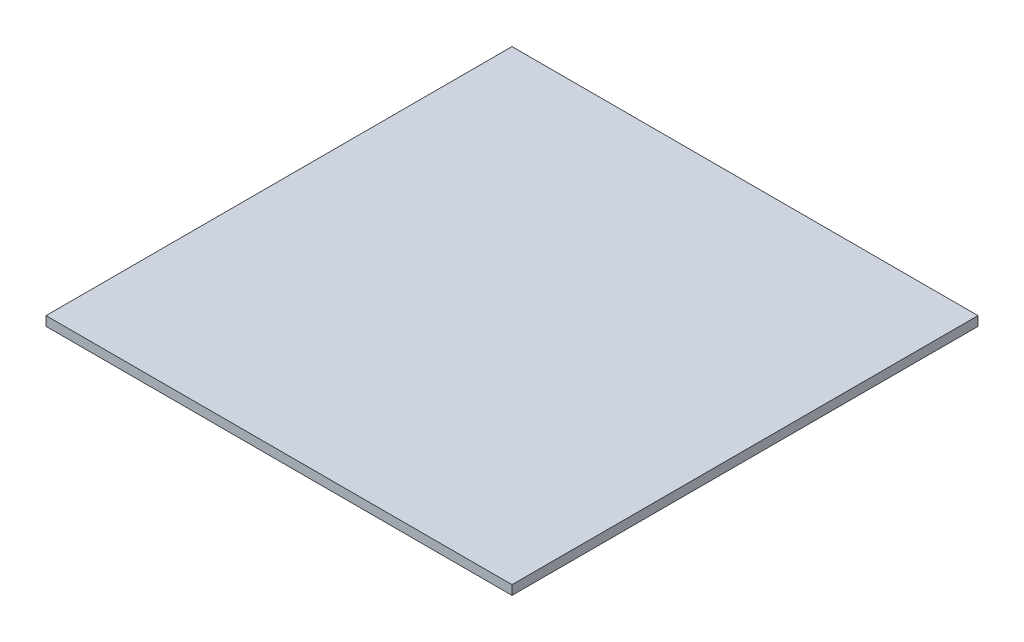
ISO-10303-21;
HEADER;
FILE_DESCRIPTION(('STEP AP214'),'2;1');
FILE_NAME('part.step','',(''),(''),'','','');
FILE_SCHEMA(('AUTOMOTIVE_DESIGN { 1 0 10303 214 1 1 1 1 }'));
ENDSEC;
DATA;
#1=APPLICATION_CONTEXT('core data for automotive mechanical design processes');
#2=APPLICATION_PROTOCOL_DEFINITION('international standard','automotive_design',2000,#1);
#3=PRODUCT_CONTEXT('',#1,'mechanical');
#4=PRODUCT('Part','Part','',(#3));
#5=PRODUCT_RELATED_PRODUCT_CATEGORY('part','',(#4));
#6=PRODUCT_DEFINITION_FORMATION('','',#4);
#7=PRODUCT_DEFINITION_CONTEXT('part definition',#1,'design');
#8=PRODUCT_DEFINITION('design','',#6,#7);
#9=PRODUCT_DEFINITION_SHAPE('','',#8);
#10=(LENGTH_UNIT() NAMED_UNIT(*) SI_UNIT(.MILLI.,.METRE.));
#11=(NAMED_UNIT(*) PLANE_ANGLE_UNIT() SI_UNIT($,.RADIAN.));
#12=(NAMED_UNIT(*) SI_UNIT($,.STERADIAN.) SOLID_ANGLE_UNIT());
#13=UNCERTAINTY_MEASURE_WITH_UNIT(LENGTH_MEASURE(1.E-05),#10,'distance_accuracy_value','');
#14=(GEOMETRIC_REPRESENTATION_CONTEXT(3) GLOBAL_UNCERTAINTY_ASSIGNED_CONTEXT((#13)) GLOBAL_UNIT_ASSIGNED_CONTEXT((#10,
#11,#12)) REPRESENTATION_CONTEXT('',''));
#15=CARTESIAN_POINT('',(0.,0.,0.));
#16=DIRECTION('',(0.,0.,1.));
#17=DIRECTION('',(1.,0.,0.));
#18=AXIS2_PLACEMENT_3D('',#15,#16,#17);
#19=CARTESIAN_POINT('',(0.,-25.4,0.));
#20=DIRECTION('',(-1.,0.,0.));
#21=DIRECTION('',(0.,0.,1.));
#22=AXIS2_PLACEMENT_3D('',#19,#20,#21);
#23=PLANE('',#22);
#24=DIRECTION('',(0.,0.,1.));
#25=VECTOR('',#24,1.);
#26=CARTESIAN_POINT('',(0.,0.,0.));
#27=LINE('',#26,#25);
#28=CARTESIAN_POINT('',(0.,0.,-1270.));
#29=VERTEX_POINT('',#28);
#30=CARTESIAN_POINT('',(0.,0.,0.));
#31=VERTEX_POINT('',#30);
#32=EDGE_CURVE('E100',#29,#31,#27,.T.);
#33=ORIENTED_EDGE('',*,*,#32,.F.);
#34=DIRECTION('',(0.,1.,0.));
#35=VECTOR('',#34,1.);
#36=CARTESIAN_POINT('',(0.,-25.4,-1270.));
#37=LINE('',#36,#35);
#38=CARTESIAN_POINT('',(0.,-25.4,-1270.));
#39=VERTEX_POINT('',#38);
#40=EDGE_CURVE('E11',#39,#29,#37,.T.);
#41=ORIENTED_EDGE('',*,*,#40,.F.);
#42=DIRECTION('',(0.,0.,1.));
#43=VECTOR('',#42,1.);
#44=CARTESIAN_POINT('',(0.,-25.4,0.));
#45=LINE('',#44,#43);
#46=CARTESIAN_POINT('',(0.,-25.4,0.));
#47=VERTEX_POINT('',#46);
#48=EDGE_CURVE('E94',#39,#47,#45,.T.);
#49=ORIENTED_EDGE('',*,*,#48,.T.);
#50=DIRECTION('',(0.,1.,0.));
#51=VECTOR('',#50,1.);
#52=CARTESIAN_POINT('',(0.,-25.4,0.));
#53=LINE('',#52,#51);
#54=EDGE_CURVE('E39',#47,#31,#53,.T.);
#55=ORIENTED_EDGE('',*,*,#54,.T.);
#56=EDGE_LOOP('',(#33,#41,#49,#55));
#57=FACE_BOUND('',#56,.T.);
#58=ADVANCED_FACE('F36',(#57),#23,.T.);
#59=CARTESIAN_POINT('',(0.,-25.4,-1270.));
#60=DIRECTION('',(0.,0.,-1.));
#61=DIRECTION('',(-1.,0.,0.));
#62=AXIS2_PLACEMENT_3D('',#59,#60,#61);
#63=PLANE('',#62);
#64=DIRECTION('',(-1.,0.,0.));
#65=VECTOR('',#64,1.);
#66=CARTESIAN_POINT('',(0.,0.,-1270.));
#67=LINE('',#66,#65);
#68=CARTESIAN_POINT('',(1270.,0.,-1270.));
#69=VERTEX_POINT('',#68);
#70=EDGE_CURVE('E96',#69,#29,#67,.T.);
#71=ORIENTED_EDGE('',*,*,#70,.F.);
#72=DIRECTION('',(0.,1.,0.));
#73=VECTOR('',#72,1.);
#74=CARTESIAN_POINT('',(1270.,-25.4,-1270.));
#75=LINE('',#74,#73);
#76=CARTESIAN_POINT('',(1270.,-25.4,-1270.));
#77=VERTEX_POINT('',#76);
#78=EDGE_CURVE('E45',#77,#69,#75,.T.);
#79=ORIENTED_EDGE('',*,*,#78,.F.);
#80=DIRECTION('',(-1.,0.,0.));
#81=VECTOR('',#80,1.);
#82=CARTESIAN_POINT('',(0.,-25.4,-1270.));
#83=LINE('',#82,#81);
#84=EDGE_CURVE('E91',#77,#39,#83,.T.);
#85=ORIENTED_EDGE('',*,*,#84,.T.);
#86=ORIENTED_EDGE('',*,*,#40,.T.);
#87=EDGE_LOOP('',(#71,#79,#85,#86));
#88=FACE_BOUND('',#87,.T.);
#89=ADVANCED_FACE('F110',(#88),#63,.T.);
#90=CARTESIAN_POINT('',(1270.,-25.4,0.));
#91=DIRECTION('',(1.,0.,0.));
#92=DIRECTION('',(0.,0.,-1.));
#93=AXIS2_PLACEMENT_3D('',#90,#91,#92);
#94=PLANE('',#93);
#95=DIRECTION('',(0.,0.,-1.));
#96=VECTOR('',#95,1.);
#97=CARTESIAN_POINT('',(1270.,0.,0.));
#98=LINE('',#97,#96);
#99=CARTESIAN_POINT('',(1270.,0.,0.));
#100=VERTEX_POINT('',#99);
#101=EDGE_CURVE('E86',#100,#69,#98,.T.);
#102=ORIENTED_EDGE('',*,*,#101,.F.);
#103=DIRECTION('',(0.,1.,0.));
#104=VECTOR('',#103,1.);
#105=CARTESIAN_POINT('',(1270.,-25.4,0.));
#106=LINE('',#105,#104);
#107=CARTESIAN_POINT('',(1270.,-25.4,0.));
#108=VERTEX_POINT('',#107);
#109=EDGE_CURVE('E81',#108,#100,#106,.T.);
#110=ORIENTED_EDGE('',*,*,#109,.F.);
#111=DIRECTION('',(0.,0.,-1.));
#112=VECTOR('',#111,1.);
#113=CARTESIAN_POINT('',(1270.,-25.4,0.));
#114=LINE('',#113,#112);
#115=EDGE_CURVE('E84',#108,#77,#114,.T.);
#116=ORIENTED_EDGE('',*,*,#115,.T.);
#117=ORIENTED_EDGE('',*,*,#78,.T.);
#118=EDGE_LOOP('',(#102,#110,#116,#117));
#119=FACE_BOUND('',#118,.T.);
#120=ADVANCED_FACE('F83',(#119),#94,.T.);
#121=CARTESIAN_POINT('',(0.,-25.4,0.));
#122=DIRECTION('',(0.,0.,1.));
#123=DIRECTION('',(1.,0.,0.));
#124=AXIS2_PLACEMENT_3D('',#121,#122,#123);
#125=PLANE('',#124);
#126=DIRECTION('',(1.,0.,0.));
#127=VECTOR('',#126,1.);
#128=CARTESIAN_POINT('',(0.,0.,0.));
#129=LINE('',#128,#127);
#130=EDGE_CURVE('E103',#31,#100,#129,.T.);
#131=ORIENTED_EDGE('',*,*,#130,.F.);
#132=ORIENTED_EDGE('',*,*,#54,.F.);
#133=DIRECTION('',(1.,0.,0.));
#134=VECTOR('',#133,1.);
#135=CARTESIAN_POINT('',(0.,-25.4,0.));
#136=LINE('',#135,#134);
#137=EDGE_CURVE('E90',#47,#108,#136,.T.);
#138=ORIENTED_EDGE('',*,*,#137,.T.);
#139=ORIENTED_EDGE('',*,*,#109,.T.);
#140=EDGE_LOOP('',(#131,#132,#138,#139));
#141=FACE_BOUND('',#140,.T.);
#142=ADVANCED_FACE('F93',(#141),#125,.T.);
#143=CARTESIAN_POINT('',(0.,-25.4,0.));
#144=DIRECTION('',(0.,-1.,0.));
#145=DIRECTION('',(0.,0.,-1.));
#146=AXIS2_PLACEMENT_3D('',#143,#144,#145);
#147=PLANE('',#146);
#148=ORIENTED_EDGE('',*,*,#48,.F.);
#149=ORIENTED_EDGE('',*,*,#84,.F.);
#150=ORIENTED_EDGE('',*,*,#115,.F.);
#151=ORIENTED_EDGE('',*,*,#137,.F.);
#152=EDGE_LOOP('',(#148,#149,#150,#151));
#153=FACE_BOUND('',#152,.T.);
#154=ADVANCED_FACE('F89',(#153),#147,.T.);
#155=CARTESIAN_POINT('',(0.,0.,0.));
#156=DIRECTION('',(0.,-1.,0.));
#157=DIRECTION('',(0.,0.,-1.));
#158=AXIS2_PLACEMENT_3D('',#155,#156,#157);
#159=PLANE('',#158);
#160=ORIENTED_EDGE('',*,*,#32,.T.);
#161=ORIENTED_EDGE('',*,*,#130,.T.);
#162=ORIENTED_EDGE('',*,*,#101,.T.);
#163=ORIENTED_EDGE('',*,*,#70,.T.);
#164=EDGE_LOOP('',(#160,#161,#162,#163));
#165=FACE_BOUND('',#164,.T.);
#166=ADVANCED_FACE('F109',(#165),#159,.F.);
#167=CLOSED_SHELL('',(#58,#89,#120,#142,#154,#166));
#168=MANIFOLD_SOLID_BREP('B2',#167);
#169=ADVANCED_BREP_SHAPE_REPRESENTATION('',(#18,#168),#14);
#170=SHAPE_DEFINITION_REPRESENTATION(#9,#169);
ENDSEC;
END-ISO-10303-21;
